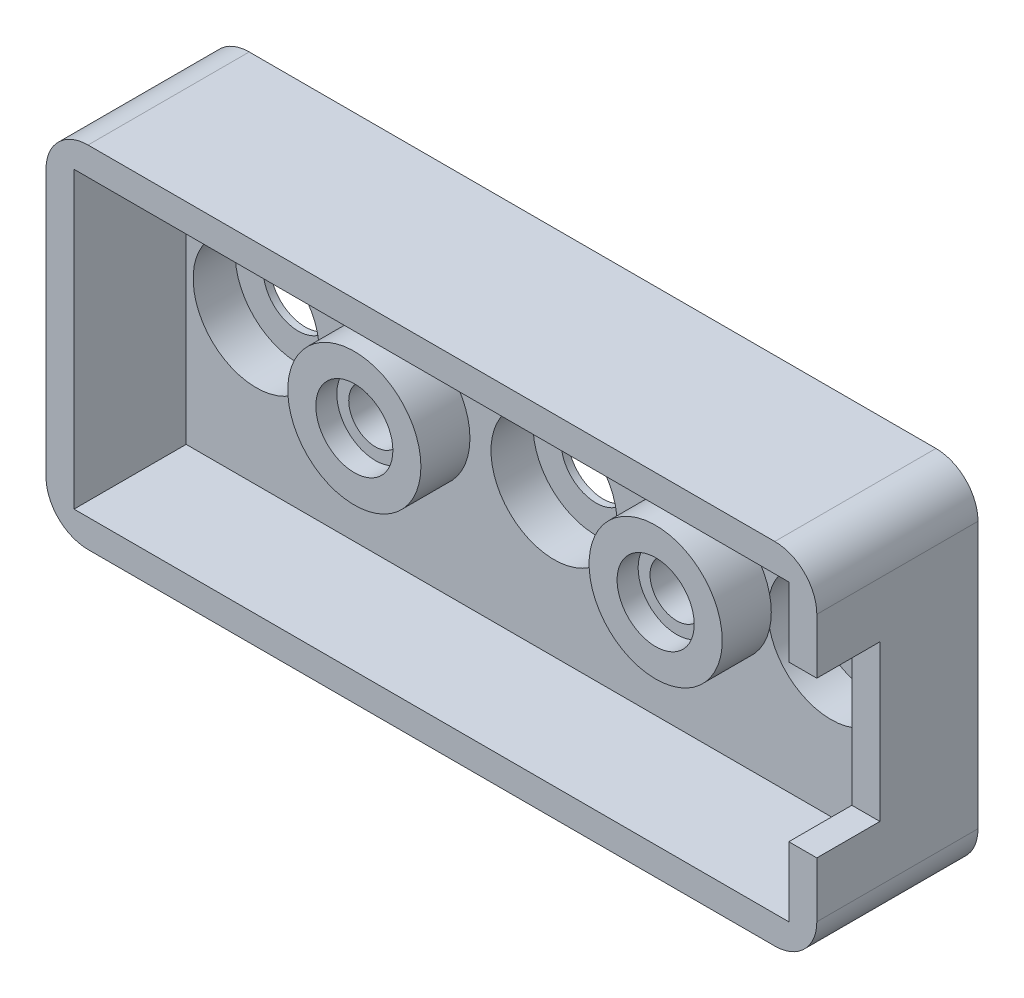
ISO-10303-21;
HEADER;
FILE_DESCRIPTION(('STEP AP214'),'2;1');
FILE_NAME('part.step','',(''),(''),'','','');
FILE_SCHEMA(('AUTOMOTIVE_DESIGN { 1 0 10303 214 1 1 1 1 }'));
ENDSEC;
DATA;
#1=APPLICATION_CONTEXT('core data for automotive mechanical design processes');
#2=APPLICATION_PROTOCOL_DEFINITION('international standard','automotive_design',2000,#1);
#3=PRODUCT_CONTEXT('',#1,'mechanical');
#4=PRODUCT('Part','Part','',(#3));
#5=PRODUCT_RELATED_PRODUCT_CATEGORY('part','',(#4));
#6=PRODUCT_DEFINITION_FORMATION('','',#4);
#7=PRODUCT_DEFINITION_CONTEXT('part definition',#1,'design');
#8=PRODUCT_DEFINITION('design','',#6,#7);
#9=PRODUCT_DEFINITION_SHAPE('','',#8);
#10=(LENGTH_UNIT() NAMED_UNIT(*) SI_UNIT(.MILLI.,.METRE.));
#11=(NAMED_UNIT(*) PLANE_ANGLE_UNIT() SI_UNIT($,.RADIAN.));
#12=(NAMED_UNIT(*) SI_UNIT($,.STERADIAN.) SOLID_ANGLE_UNIT());
#13=UNCERTAINTY_MEASURE_WITH_UNIT(LENGTH_MEASURE(1.E-05),#10,'distance_accuracy_value','');
#14=(GEOMETRIC_REPRESENTATION_CONTEXT(3) GLOBAL_UNCERTAINTY_ASSIGNED_CONTEXT((#13)) GLOBAL_UNIT_ASSIGNED_CONTEXT((#10,
#11,#12)) REPRESENTATION_CONTEXT('',''));
#15=CARTESIAN_POINT('',(0.,0.,0.));
#16=DIRECTION('',(0.,0.,1.));
#17=DIRECTION('',(1.,0.,0.));
#18=AXIS2_PLACEMENT_3D('',#15,#16,#17);
#19=CARTESIAN_POINT('',(-10.,0.,-1.5));
#20=DIRECTION('',(0.,0.,1.));
#21=DIRECTION('',(1.,0.,0.));
#22=AXIS2_PLACEMENT_3D('',#19,#20,#21);
#23=CYLINDRICAL_SURFACE('',#22,2.75);
#24=CARTESIAN_POINT('',(-10.,0.,5.5));
#25=DIRECTION('',(0.,0.,1.));
#26=DIRECTION('',(1.,0.,0.));
#27=AXIS2_PLACEMENT_3D('',#24,#25,#26);
#28=CIRCLE('',#27,2.75);
#29=CARTESIAN_POINT('',(-7.25000000000001,0.,5.5));
#30=VERTEX_POINT('',#29);
#31=EDGE_CURVE('E218',#30,#30,#28,.T.);
#32=ORIENTED_EDGE('',*,*,#31,.T.);
#33=EDGE_LOOP('',(#32));
#34=FACE_BOUND('',#33,.T.);
#35=CARTESIAN_POINT('',(-10.,0.,4.));
#36=DIRECTION('',(0.,0.,-1.));
#37=DIRECTION('',(-1.,0.,0.));
#38=AXIS2_PLACEMENT_3D('',#35,#36,#37);
#39=CIRCLE('',#38,2.75);
#40=CARTESIAN_POINT('',(-12.75,0.,4.));
#41=VERTEX_POINT('',#40);
#42=EDGE_CURVE('E12',#41,#41,#39,.F.);
#43=ORIENTED_EDGE('',*,*,#42,.F.);
#44=EDGE_LOOP('',(#43));
#45=FACE_BOUND('',#44,.T.);
#46=ADVANCED_FACE('F75',(#34,#45),#23,.F.);
#47=CARTESIAN_POINT('',(11.5,0.,-1.5));
#48=DIRECTION('',(0.,0.,1.));
#49=DIRECTION('',(1.,0.,0.));
#50=AXIS2_PLACEMENT_3D('',#47,#48,#49);
#51=CYLINDRICAL_SURFACE('',#50,2.75);
#52=CARTESIAN_POINT('',(11.5,0.,5.5));
#53=DIRECTION('',(0.,0.,1.));
#54=DIRECTION('',(1.,0.,0.));
#55=AXIS2_PLACEMENT_3D('',#52,#53,#54);
#56=CIRCLE('',#55,2.75);
#57=CARTESIAN_POINT('',(14.25,0.,5.5));
#58=VERTEX_POINT('',#57);
#59=EDGE_CURVE('E216',#58,#58,#56,.T.);
#60=ORIENTED_EDGE('',*,*,#59,.T.);
#61=EDGE_LOOP('',(#60));
#62=FACE_BOUND('',#61,.T.);
#63=CARTESIAN_POINT('',(11.5,0.,4.));
#64=DIRECTION('',(0.,0.,-1.));
#65=DIRECTION('',(-1.,0.,0.));
#66=AXIS2_PLACEMENT_3D('',#63,#64,#65);
#67=CIRCLE('',#66,2.75);
#68=CARTESIAN_POINT('',(8.74999999999999,0.,4.));
#69=VERTEX_POINT('',#68);
#70=EDGE_CURVE('E84',#69,#69,#67,.F.);
#71=ORIENTED_EDGE('',*,*,#70,.F.);
#72=EDGE_LOOP('',(#71));
#73=FACE_BOUND('',#72,.T.);
#74=ADVANCED_FACE('F435',(#62,#73),#51,.F.);
#75=CARTESIAN_POINT('',(0.,0.,2.));
#76=DIRECTION('',(0.,0.,1.));
#77=DIRECTION('',(1.,0.,0.));
#78=AXIS2_PLACEMENT_3D('',#75,#76,#77);
#79=PLANE('',#78);
#80=CARTESIAN_POINT('',(20.5018902687231,0.,2.));
#81=DIRECTION('',(0.,0.,1.));
#82=DIRECTION('',(1.,0.,0.));
#83=AXIS2_PLACEMENT_3D('',#80,#81,#82);
#84=CIRCLE('',#83,4.5);
#85=CARTESIAN_POINT('',(16.1293903792472,-1.06359988554604,2.));
#86=VERTEX_POINT('',#85);
#87=CARTESIAN_POINT('',(16.1293903792472,1.06359988554604,2.));
#88=VERTEX_POINT('',#87);
#89=EDGE_CURVE('E193',#86,#88,#84,.T.);
#90=ORIENTED_EDGE('',*,*,#89,.F.);
#91=CARTESIAN_POINT('',(11.5,0.,2.));
#92=DIRECTION('',(0.,0.,1.));
#93=DIRECTION('',(1.,0.,0.));
#94=AXIS2_PLACEMENT_3D('',#91,#92,#93);
#95=CIRCLE('',#94,4.75);
#96=EDGE_CURVE('E211',#88,#86,#95,.T.);
#97=ORIENTED_EDGE('',*,*,#96,.F.);
#98=EDGE_LOOP('',(#90,#97));
#99=FACE_BOUND('',#98,.T.);
#100=CARTESIAN_POINT('',(0.749999999999993,0.,2.));
#101=DIRECTION('',(0.,0.,1.));
#102=DIRECTION('',(1.,0.,0.));
#103=AXIS2_PLACEMENT_3D('',#100,#101,#102);
#104=CIRCLE('',#103,4.5);
#105=CARTESIAN_POINT('',(5.24999999999999,0.,2.));
#106=VERTEX_POINT('',#105);
#107=EDGE_CURVE('E312',#106,#106,#104,.T.);
#108=ORIENTED_EDGE('',*,*,#107,.F.);
#109=EDGE_LOOP('',(#108));
#110=FACE_BOUND('',#109,.T.);
#111=CARTESIAN_POINT('',(-20.5,0.,2.));
#112=DIRECTION('',(0.,0.,1.));
#113=DIRECTION('',(1.,0.,0.));
#114=AXIS2_PLACEMENT_3D('',#111,#112,#113);
#115=CIRCLE('',#114,4.5);
#116=CARTESIAN_POINT('',(-16.,0.,2.));
#117=VERTEX_POINT('',#116);
#118=EDGE_CURVE('E309',#117,#117,#115,.T.);
#119=ORIENTED_EDGE('',*,*,#118,.F.);
#120=EDGE_LOOP('',(#119));
#121=FACE_BOUND('',#120,.T.);
#122=DIRECTION('',(1.,0.,0.));
#123=VECTOR('',#122,1.);
#124=CARTESIAN_POINT('',(-25.5,-10.5,2.));
#125=LINE('',#124,#123);
#126=CARTESIAN_POINT('',(-25.5,-10.5,2.));
#127=VERTEX_POINT('',#126);
#128=CARTESIAN_POINT('',(25.5,-10.5,2.));
#129=VERTEX_POINT('',#128);
#130=EDGE_CURVE('E329',#127,#129,#125,.T.);
#131=ORIENTED_EDGE('',*,*,#130,.T.);
#132=DIRECTION('',(0.,-1.,0.));
#133=VECTOR('',#132,1.);
#134=CARTESIAN_POINT('',(25.5,10.5,2.));
#135=LINE('',#134,#133);
#136=CARTESIAN_POINT('',(25.5,10.5,2.));
#137=VERTEX_POINT('',#136);
#138=EDGE_CURVE('E350',#137,#129,#135,.T.);
#139=ORIENTED_EDGE('',*,*,#138,.F.);
#140=DIRECTION('',(1.,0.,0.));
#141=VECTOR('',#140,1.);
#142=CARTESIAN_POINT('',(-25.5,10.5,2.));
#143=LINE('',#142,#141);
#144=CARTESIAN_POINT('',(-25.5,10.5,2.));
#145=VERTEX_POINT('',#144);
#146=EDGE_CURVE('E353',#145,#137,#143,.T.);
#147=ORIENTED_EDGE('',*,*,#146,.F.);
#148=DIRECTION('',(0.,-1.,0.));
#149=VECTOR('',#148,1.);
#150=CARTESIAN_POINT('',(-25.5,10.5,2.));
#151=LINE('',#150,#149);
#152=EDGE_CURVE('E339',#145,#127,#151,.T.);
#153=ORIENTED_EDGE('',*,*,#152,.T.);
#154=EDGE_LOOP('',(#131,#139,#147,#153));
#155=FACE_BOUND('',#154,.T.);
#156=CARTESIAN_POINT('',(-10.,0.,2.));
#157=DIRECTION('',(0.,0.,1.));
#158=DIRECTION('',(1.,0.,0.));
#159=AXIS2_PLACEMENT_3D('',#156,#157,#158);
#160=CIRCLE('',#159,4.75);
#161=CARTESIAN_POINT('',(-5.25000000000001,0.,2.));
#162=VERTEX_POINT('',#161);
#163=EDGE_CURVE('E228',#162,#162,#160,.T.);
#164=ORIENTED_EDGE('',*,*,#163,.F.);
#165=EDGE_LOOP('',(#164));
#166=FACE_BOUND('',#165,.T.);
#167=ADVANCED_FACE('F214',(#99,#110,#121,#155,#166),#79,.T.);
#168=CARTESIAN_POINT('',(27.5,12.5,-1.5));
#169=DIRECTION('',(1.,0.,0.));
#170=DIRECTION('',(0.,0.,-1.));
#171=AXIS2_PLACEMENT_3D('',#168,#169,#170);
#172=PLANE('',#171);
#173=DIRECTION('',(0.,-1.,0.));
#174=VECTOR('',#173,1.);
#175=CARTESIAN_POINT('',(27.5,5.55104168263553,5.5));
#176=LINE('',#175,#174);
#177=CARTESIAN_POINT('',(27.5,5.55104168263553,5.5));
#178=VERTEX_POINT('',#177);
#179=CARTESIAN_POINT('',(27.5,-5.55104168263553,5.5));
#180=VERTEX_POINT('',#179);
#181=EDGE_CURVE('E502',#178,#180,#176,.T.);
#182=ORIENTED_EDGE('',*,*,#181,.T.);
#183=DIRECTION('',(0.,0.,1.));
#184=VECTOR('',#183,1.);
#185=CARTESIAN_POINT('',(27.5,-5.55104168263553,4.));
#186=LINE('',#185,#184);
#187=CARTESIAN_POINT('',(27.5,-5.55104168263553,10.));
#188=VERTEX_POINT('',#187);
#189=EDGE_CURVE('E97',#180,#188,#186,.T.);
#190=ORIENTED_EDGE('',*,*,#189,.T.);
#191=DIRECTION('',(0.,1.,0.));
#192=VECTOR('',#191,1.);
#193=CARTESIAN_POINT('',(27.5,-12.5,10.));
#194=LINE('',#193,#192);
#195=CARTESIAN_POINT('',(27.5,-9.5,10.));
#196=VERTEX_POINT('',#195);
#197=EDGE_CURVE('E372',#196,#188,#194,.T.);
#198=ORIENTED_EDGE('',*,*,#197,.F.);
#199=DIRECTION('',(0.,0.,1.));
#200=VECTOR('',#199,1.);
#201=CARTESIAN_POINT('',(27.5,-9.5,-1.5));
#202=LINE('',#201,#200);
#203=CARTESIAN_POINT('',(27.5,-9.5,-1.5));
#204=VERTEX_POINT('',#203);
#205=EDGE_CURVE('E272',#196,#204,#202,.F.);
#206=ORIENTED_EDGE('',*,*,#205,.T.);
#207=DIRECTION('',(0.,1.,0.));
#208=VECTOR('',#207,1.);
#209=CARTESIAN_POINT('',(27.5,12.5,-1.5));
#210=LINE('',#209,#208);
#211=CARTESIAN_POINT('',(27.5,9.5,-1.5));
#212=VERTEX_POINT('',#211);
#213=EDGE_CURVE('E232',#204,#212,#210,.T.);
#214=ORIENTED_EDGE('',*,*,#213,.T.);
#215=DIRECTION('',(0.,0.,1.));
#216=VECTOR('',#215,1.);
#217=CARTESIAN_POINT('',(27.5,9.5,-1.5));
#218=LINE('',#217,#216);
#219=CARTESIAN_POINT('',(27.5,9.49999999999999,10.));
#220=VERTEX_POINT('',#219);
#221=EDGE_CURVE('E274',#212,#220,#218,.T.);
#222=ORIENTED_EDGE('',*,*,#221,.T.);
#223=CARTESIAN_POINT('',(27.5,5.55104168263553,10.));
#224=VERTEX_POINT('',#223);
#225=EDGE_CURVE('E371',#224,#220,#194,.T.);
#226=ORIENTED_EDGE('',*,*,#225,.F.);
#227=DIRECTION('',(0.,0.,1.));
#228=VECTOR('',#227,1.);
#229=CARTESIAN_POINT('',(27.5,5.55104168263553,4.));
#230=LINE('',#229,#228);
#231=EDGE_CURVE('E327',#178,#224,#230,.T.);
#232=ORIENTED_EDGE('',*,*,#231,.F.);
#233=EDGE_LOOP('',(#182,#190,#198,#206,#214,#222,#226,#232));
#234=FACE_BOUND('',#233,.T.);
#235=ADVANCED_FACE('F405',(#234),#172,.T.);
#236=CARTESIAN_POINT('',(-27.5,-12.5,-1.5));
#237=DIRECTION('',(0.,-1.,0.));
#238=DIRECTION('',(0.,0.,-1.));
#239=AXIS2_PLACEMENT_3D('',#236,#237,#238);
#240=PLANE('',#239);
#241=DIRECTION('',(1.,0.,0.));
#242=VECTOR('',#241,1.);
#243=CARTESIAN_POINT('',(-27.5,-12.5,-1.5));
#244=LINE('',#243,#242);
#245=CARTESIAN_POINT('',(-24.5,-12.5,-1.5));
#246=VERTEX_POINT('',#245);
#247=CARTESIAN_POINT('',(24.5,-12.5,-1.5));
#248=VERTEX_POINT('',#247);
#249=EDGE_CURVE('E243',#246,#248,#244,.T.);
#250=ORIENTED_EDGE('',*,*,#249,.T.);
#251=DIRECTION('',(0.,0.,1.));
#252=VECTOR('',#251,1.);
#253=CARTESIAN_POINT('',(24.5,-12.5,-1.5));
#254=LINE('',#253,#252);
#255=CARTESIAN_POINT('',(24.5,-12.5,10.));
#256=VERTEX_POINT('',#255);
#257=EDGE_CURVE('E201',#248,#256,#254,.T.);
#258=ORIENTED_EDGE('',*,*,#257,.T.);
#259=DIRECTION('',(1.,0.,0.));
#260=VECTOR('',#259,1.);
#261=CARTESIAN_POINT('',(-27.5,-12.5,10.));
#262=LINE('',#261,#260);
#263=CARTESIAN_POINT('',(-24.5,-12.5,10.));
#264=VERTEX_POINT('',#263);
#265=EDGE_CURVE('E374',#264,#256,#262,.T.);
#266=ORIENTED_EDGE('',*,*,#265,.F.);
#267=DIRECTION('',(0.,0.,1.));
#268=VECTOR('',#267,1.);
#269=CARTESIAN_POINT('',(-24.5,-12.5,-1.5));
#270=LINE('',#269,#268);
#271=EDGE_CURVE('E277',#264,#246,#270,.F.);
#272=ORIENTED_EDGE('',*,*,#271,.T.);
#273=EDGE_LOOP('',(#250,#258,#266,#272));
#274=FACE_BOUND('',#273,.T.);
#275=ADVANCED_FACE('F415',(#274),#240,.T.);
#276=CARTESIAN_POINT('',(-27.5,12.5,-1.5));
#277=DIRECTION('',(-1.,0.,0.));
#278=DIRECTION('',(0.,-1.,0.));
#279=AXIS2_PLACEMENT_3D('',#276,#277,#278);
#280=PLANE('',#279);
#281=DIRECTION('',(0.,1.,0.));
#282=VECTOR('',#281,1.);
#283=CARTESIAN_POINT('',(-27.5,-12.5,10.));
#284=LINE('',#283,#282);
#285=CARTESIAN_POINT('',(-27.5,-9.5,10.));
#286=VERTEX_POINT('',#285);
#287=CARTESIAN_POINT('',(-27.5,9.49999999999999,10.));
#288=VERTEX_POINT('',#287);
#289=EDGE_CURVE('E222',#286,#288,#284,.T.);
#290=ORIENTED_EDGE('',*,*,#289,.T.);
#291=DIRECTION('',(0.,0.,1.));
#292=VECTOR('',#291,1.);
#293=CARTESIAN_POINT('',(-27.5,9.5,-1.5));
#294=LINE('',#293,#292);
#295=CARTESIAN_POINT('',(-27.5,9.5,-1.5));
#296=VERTEX_POINT('',#295);
#297=EDGE_CURVE('E262',#288,#296,#294,.F.);
#298=ORIENTED_EDGE('',*,*,#297,.T.);
#299=DIRECTION('',(0.,-1.,0.));
#300=VECTOR('',#299,1.);
#301=CARTESIAN_POINT('',(-27.5,12.5,-1.5));
#302=LINE('',#301,#300);
#303=CARTESIAN_POINT('',(-27.5,-9.5,-1.5));
#304=VERTEX_POINT('',#303);
#305=EDGE_CURVE('E240',#296,#304,#302,.T.);
#306=ORIENTED_EDGE('',*,*,#305,.T.);
#307=DIRECTION('',(0.,0.,1.));
#308=VECTOR('',#307,1.);
#309=CARTESIAN_POINT('',(-27.5,-9.5,-1.5));
#310=LINE('',#309,#308);
#311=EDGE_CURVE('E259',#304,#286,#310,.T.);
#312=ORIENTED_EDGE('',*,*,#311,.T.);
#313=EDGE_LOOP('',(#290,#298,#306,#312));
#314=FACE_BOUND('',#313,.T.);
#315=ADVANCED_FACE('F382',(#314),#280,.T.);
#316=CARTESIAN_POINT('',(-27.5,12.5,-1.5));
#317=DIRECTION('',(0.,1.,0.));
#318=DIRECTION('',(0.,0.,1.));
#319=AXIS2_PLACEMENT_3D('',#316,#317,#318);
#320=PLANE('',#319);
#321=DIRECTION('',(-1.,0.,0.));
#322=VECTOR('',#321,1.);
#323=CARTESIAN_POINT('',(-27.5,12.5,-1.5));
#324=LINE('',#323,#322);
#325=CARTESIAN_POINT('',(24.5,12.5,-1.5));
#326=VERTEX_POINT('',#325);
#327=CARTESIAN_POINT('',(-24.5,12.5,-1.5));
#328=VERTEX_POINT('',#327);
#329=EDGE_CURVE('E237',#326,#328,#324,.T.);
#330=ORIENTED_EDGE('',*,*,#329,.T.);
#331=DIRECTION('',(0.,0.,1.));
#332=VECTOR('',#331,1.);
#333=CARTESIAN_POINT('',(-24.5,12.5,-1.5));
#334=LINE('',#333,#332);
#335=CARTESIAN_POINT('',(-24.5,12.5,10.));
#336=VERTEX_POINT('',#335);
#337=EDGE_CURVE('E248',#328,#336,#334,.T.);
#338=ORIENTED_EDGE('',*,*,#337,.T.);
#339=DIRECTION('',(1.,0.,0.));
#340=VECTOR('',#339,1.);
#341=CARTESIAN_POINT('',(-27.5,12.5,10.));
#342=LINE('',#341,#340);
#343=CARTESIAN_POINT('',(24.5,12.5,10.));
#344=VERTEX_POINT('',#343);
#345=EDGE_CURVE('E368',#336,#344,#342,.T.);
#346=ORIENTED_EDGE('',*,*,#345,.T.);
#347=DIRECTION('',(0.,0.,1.));
#348=VECTOR('',#347,1.);
#349=CARTESIAN_POINT('',(24.5,12.5,-1.5));
#350=LINE('',#349,#348);
#351=EDGE_CURVE('E246',#344,#326,#350,.F.);
#352=ORIENTED_EDGE('',*,*,#351,.T.);
#353=EDGE_LOOP('',(#330,#338,#346,#352));
#354=FACE_BOUND('',#353,.T.);
#355=ADVANCED_FACE('F394',(#354),#320,.T.);
#356=CARTESIAN_POINT('',(0.,0.,-1.5));
#357=DIRECTION('',(0.,0.,1.));
#358=DIRECTION('',(1.,0.,0.));
#359=AXIS2_PLACEMENT_3D('',#356,#357,#358);
#360=PLANE('',#359);
#361=CARTESIAN_POINT('',(20.5018902687231,0.,-1.5));
#362=DIRECTION('',(0.,0.,1.));
#363=DIRECTION('',(1.,0.,0.));
#364=AXIS2_PLACEMENT_3D('',#361,#362,#363);
#365=CIRCLE('',#364,2.5);
#366=CARTESIAN_POINT('',(23.0018902687231,0.,-1.5));
#367=VERTEX_POINT('',#366);
#368=EDGE_CURVE('E293',#367,#367,#365,.T.);
#369=ORIENTED_EDGE('',*,*,#368,.T.);
#370=EDGE_LOOP('',(#369));
#371=FACE_BOUND('',#370,.T.);
#372=CARTESIAN_POINT('',(0.749999999999993,0.,-1.5));
#373=DIRECTION('',(0.,0.,1.));
#374=DIRECTION('',(1.,0.,0.));
#375=AXIS2_PLACEMENT_3D('',#372,#373,#374);
#376=CIRCLE('',#375,2.5);
#377=CARTESIAN_POINT('',(3.24999999999999,0.,-1.5));
#378=VERTEX_POINT('',#377);
#379=EDGE_CURVE('E511',#378,#378,#376,.T.);
#380=ORIENTED_EDGE('',*,*,#379,.T.);
#381=EDGE_LOOP('',(#380));
#382=FACE_BOUND('',#381,.T.);
#383=CARTESIAN_POINT('',(-20.5,0.,-1.5));
#384=DIRECTION('',(0.,0.,1.));
#385=DIRECTION('',(1.,0.,0.));
#386=AXIS2_PLACEMENT_3D('',#383,#384,#385);
#387=CIRCLE('',#386,2.5);
#388=CARTESIAN_POINT('',(-18.,0.,-1.5));
#389=VERTEX_POINT('',#388);
#390=EDGE_CURVE('E507',#389,#389,#387,.T.);
#391=ORIENTED_EDGE('',*,*,#390,.T.);
#392=EDGE_LOOP('',(#391));
#393=FACE_BOUND('',#392,.T.);
#394=CARTESIAN_POINT('',(-10.,0.,-1.5));
#395=DIRECTION('',(0.,0.,1.));
#396=DIRECTION('',(1.,0.,0.));
#397=AXIS2_PLACEMENT_3D('',#394,#395,#396);
#398=CIRCLE('',#397,1.9);
#399=CARTESIAN_POINT('',(-8.10000000000001,0.,-1.5));
#400=VERTEX_POINT('',#399);
#401=EDGE_CURVE('E287',#400,#400,#398,.T.);
#402=ORIENTED_EDGE('',*,*,#401,.T.);
#403=EDGE_LOOP('',(#402));
#404=FACE_BOUND('',#403,.T.);
#405=CARTESIAN_POINT('',(11.5,0.,-1.5));
#406=DIRECTION('',(0.,0.,1.));
#407=DIRECTION('',(1.,0.,0.));
#408=AXIS2_PLACEMENT_3D('',#405,#406,#407);
#409=CIRCLE('',#408,1.9);
#410=CARTESIAN_POINT('',(13.4,0.,-1.5));
#411=VERTEX_POINT('',#410);
#412=EDGE_CURVE('E298',#411,#411,#409,.T.);
#413=ORIENTED_EDGE('',*,*,#412,.T.);
#414=EDGE_LOOP('',(#413));
#415=FACE_BOUND('',#414,.T.);
#416=ORIENTED_EDGE('',*,*,#305,.F.);
#417=CARTESIAN_POINT('',(-24.5,9.5,-1.5));
#418=DIRECTION('',(0.,0.,1.));
#419=DIRECTION('',(1.,0.,0.));
#420=AXIS2_PLACEMENT_3D('',#417,#418,#419);
#421=CIRCLE('',#420,3.);
#422=EDGE_CURVE('E270',#296,#328,#421,.F.);
#423=ORIENTED_EDGE('',*,*,#422,.T.);
#424=ORIENTED_EDGE('',*,*,#329,.F.);
#425=CARTESIAN_POINT('',(24.5,9.5,-1.5));
#426=DIRECTION('',(0.,0.,1.));
#427=DIRECTION('',(1.,0.,0.));
#428=AXIS2_PLACEMENT_3D('',#425,#426,#427);
#429=CIRCLE('',#428,3.);
#430=EDGE_CURVE('E268',#326,#212,#429,.F.);
#431=ORIENTED_EDGE('',*,*,#430,.T.);
#432=ORIENTED_EDGE('',*,*,#213,.F.);
#433=CARTESIAN_POINT('',(24.5,-9.5,-1.5));
#434=DIRECTION('',(0.,0.,1.));
#435=DIRECTION('',(1.,0.,0.));
#436=AXIS2_PLACEMENT_3D('',#433,#434,#435);
#437=CIRCLE('',#436,3.);
#438=EDGE_CURVE('E266',#204,#248,#437,.F.);
#439=ORIENTED_EDGE('',*,*,#438,.T.);
#440=ORIENTED_EDGE('',*,*,#249,.F.);
#441=CARTESIAN_POINT('',(-24.5,-9.5,-1.5));
#442=DIRECTION('',(0.,0.,1.));
#443=DIRECTION('',(1.,0.,0.));
#444=AXIS2_PLACEMENT_3D('',#441,#442,#443);
#445=CIRCLE('',#444,3.);
#446=EDGE_CURVE('E264',#246,#304,#445,.F.);
#447=ORIENTED_EDGE('',*,*,#446,.T.);
#448=EDGE_LOOP('',(#416,#423,#424,#431,#432,#439,#440,#447));
#449=FACE_BOUND('',#448,.T.);
#450=ADVANCED_FACE('F391',(#371,#382,#393,#404,#415,#449),#360,.F.);
#451=CARTESIAN_POINT('',(-10.,0.,5.5));
#452=DIRECTION('',(0.,0.,1.));
#453=DIRECTION('',(1.,0.,0.));
#454=AXIS2_PLACEMENT_3D('',#451,#452,#453);
#455=PLANE('',#454);
#456=CARTESIAN_POINT('',(-10.,0.,5.5));
#457=DIRECTION('',(0.,0.,1.));
#458=DIRECTION('',(1.,0.,0.));
#459=AXIS2_PLACEMENT_3D('',#456,#457,#458);
#460=CIRCLE('',#459,4.75);
#461=CARTESIAN_POINT('',(-5.25000000000001,0.,5.5));
#462=VERTEX_POINT('',#461);
#463=EDGE_CURVE('E229',#462,#462,#460,.T.);
#464=ORIENTED_EDGE('',*,*,#463,.T.);
#465=EDGE_LOOP('',(#464));
#466=FACE_BOUND('',#465,.T.);
#467=ORIENTED_EDGE('',*,*,#31,.F.);
#468=EDGE_LOOP('',(#467));
#469=FACE_BOUND('',#468,.T.);
#470=ADVANCED_FACE('F448',(#466,#469),#455,.T.);
#471=CARTESIAN_POINT('',(-10.,0.,5.5));
#472=DIRECTION('',(0.,0.,-1.));
#473=DIRECTION('',(-1.,0.,0.));
#474=AXIS2_PLACEMENT_3D('',#471,#472,#473);
#475=CYLINDRICAL_SURFACE('',#474,4.75);
#476=ORIENTED_EDGE('',*,*,#463,.F.);
#477=EDGE_LOOP('',(#476));
#478=FACE_BOUND('',#477,.T.);
#479=ORIENTED_EDGE('',*,*,#163,.T.);
#480=EDGE_LOOP('',(#479));
#481=FACE_BOUND('',#480,.T.);
#482=ADVANCED_FACE('F581',(#478,#481),#475,.T.);
#483=CARTESIAN_POINT('',(11.5,0.,5.5));
#484=DIRECTION('',(0.,0.,1.));
#485=DIRECTION('',(1.,0.,0.));
#486=AXIS2_PLACEMENT_3D('',#483,#484,#485);
#487=PLANE('',#486);
#488=CARTESIAN_POINT('',(11.5,0.,5.5));
#489=DIRECTION('',(0.,0.,1.));
#490=DIRECTION('',(1.,0.,0.));
#491=AXIS2_PLACEMENT_3D('',#488,#489,#490);
#492=CIRCLE('',#491,4.75);
#493=CARTESIAN_POINT('',(16.25,0.,5.5));
#494=VERTEX_POINT('',#493);
#495=EDGE_CURVE('E212',#494,#494,#492,.T.);
#496=ORIENTED_EDGE('',*,*,#495,.T.);
#497=EDGE_LOOP('',(#496));
#498=FACE_BOUND('',#497,.T.);
#499=ORIENTED_EDGE('',*,*,#59,.F.);
#500=EDGE_LOOP('',(#499));
#501=FACE_BOUND('',#500,.T.);
#502=ADVANCED_FACE('F431',(#498,#501),#487,.T.);
#503=CARTESIAN_POINT('',(11.5,0.,5.5));
#504=DIRECTION('',(0.,0.,-1.));
#505=DIRECTION('',(-1.,0.,0.));
#506=AXIS2_PLACEMENT_3D('',#503,#504,#505);
#507=CYLINDRICAL_SURFACE('',#506,4.75);
#508=ORIENTED_EDGE('',*,*,#495,.F.);
#509=EDGE_LOOP('',(#508));
#510=FACE_BOUND('',#509,.T.);
#511=ORIENTED_EDGE('',*,*,#96,.T.);
#512=EDGE_CURVE('E206',#86,#88,#95,.T.);
#513=ORIENTED_EDGE('',*,*,#512,.T.);
#514=EDGE_LOOP('',(#511,#513));
#515=FACE_BOUND('',#514,.T.);
#516=ADVANCED_FACE('F210',(#510,#515),#507,.T.);
#517=CARTESIAN_POINT('',(0.,0.,10.));
#518=DIRECTION('',(0.,0.,1.));
#519=DIRECTION('',(1.,0.,0.));
#520=AXIS2_PLACEMENT_3D('',#517,#518,#519);
#521=PLANE('',#520);
#522=DIRECTION('',(1.,0.,0.));
#523=VECTOR('',#522,1.);
#524=CARTESIAN_POINT('',(25.5,-5.55104168263553,10.));
#525=LINE('',#524,#523);
#526=CARTESIAN_POINT('',(25.5,-5.55104168263553,10.));
#527=VERTEX_POINT('',#526);
#528=EDGE_CURVE('E325',#527,#188,#525,.T.);
#529=ORIENTED_EDGE('',*,*,#528,.F.);
#530=DIRECTION('',(0.,-1.,0.));
#531=VECTOR('',#530,1.);
#532=CARTESIAN_POINT('',(25.5,10.5,10.));
#533=LINE('',#532,#531);
#534=CARTESIAN_POINT('',(25.5,-10.5,10.));
#535=VERTEX_POINT('',#534);
#536=EDGE_CURVE('E338',#527,#535,#533,.T.);
#537=ORIENTED_EDGE('',*,*,#536,.T.);
#538=DIRECTION('',(1.,0.,0.));
#539=VECTOR('',#538,1.);
#540=CARTESIAN_POINT('',(-25.5,-10.5,10.));
#541=LINE('',#540,#539);
#542=CARTESIAN_POINT('',(-25.5,-10.5,10.));
#543=VERTEX_POINT('',#542);
#544=EDGE_CURVE('E335',#543,#535,#541,.T.);
#545=ORIENTED_EDGE('',*,*,#544,.F.);
#546=DIRECTION('',(0.,-1.,0.));
#547=VECTOR('',#546,1.);
#548=CARTESIAN_POINT('',(-25.5,10.5,10.));
#549=LINE('',#548,#547);
#550=CARTESIAN_POINT('',(-25.5,10.5,10.));
#551=VERTEX_POINT('',#550);
#552=EDGE_CURVE('E346',#551,#543,#549,.T.);
#553=ORIENTED_EDGE('',*,*,#552,.F.);
#554=DIRECTION('',(1.,0.,0.));
#555=VECTOR('',#554,1.);
#556=CARTESIAN_POINT('',(-25.5,10.5,10.));
#557=LINE('',#556,#555);
#558=CARTESIAN_POINT('',(25.5,10.5,10.));
#559=VERTEX_POINT('',#558);
#560=EDGE_CURVE('E343',#551,#559,#557,.T.);
#561=ORIENTED_EDGE('',*,*,#560,.T.);
#562=CARTESIAN_POINT('',(25.5,5.55104168263553,10.));
#563=VERTEX_POINT('',#562);
#564=EDGE_CURVE('E340',#559,#563,#533,.T.);
#565=ORIENTED_EDGE('',*,*,#564,.T.);
#566=DIRECTION('',(-1.,0.,0.));
#567=VECTOR('',#566,1.);
#568=CARTESIAN_POINT('',(25.5,5.55104168263553,10.));
#569=LINE('',#568,#567);
#570=EDGE_CURVE('E320',#224,#563,#569,.T.);
#571=ORIENTED_EDGE('',*,*,#570,.F.);
#572=ORIENTED_EDGE('',*,*,#225,.T.);
#573=CARTESIAN_POINT('',(24.5,9.5,10.));
#574=DIRECTION('',(0.,0.,1.));
#575=DIRECTION('',(1.,0.,0.));
#576=AXIS2_PLACEMENT_3D('',#573,#574,#575);
#577=CIRCLE('',#576,3.);
#578=EDGE_CURVE('E255',#220,#344,#577,.T.);
#579=ORIENTED_EDGE('',*,*,#578,.T.);
#580=ORIENTED_EDGE('',*,*,#345,.F.);
#581=CARTESIAN_POINT('',(-24.5,9.5,10.));
#582=DIRECTION('',(0.,0.,1.));
#583=DIRECTION('',(1.,0.,0.));
#584=AXIS2_PLACEMENT_3D('',#581,#582,#583);
#585=CIRCLE('',#584,3.);
#586=EDGE_CURVE('E257',#336,#288,#585,.T.);
#587=ORIENTED_EDGE('',*,*,#586,.T.);
#588=ORIENTED_EDGE('',*,*,#289,.F.);
#589=CARTESIAN_POINT('',(-24.5,-9.5,10.));
#590=DIRECTION('',(0.,0.,1.));
#591=DIRECTION('',(1.,0.,0.));
#592=AXIS2_PLACEMENT_3D('',#589,#590,#591);
#593=CIRCLE('',#592,3.);
#594=EDGE_CURVE('E251',#286,#264,#593,.T.);
#595=ORIENTED_EDGE('',*,*,#594,.T.);
#596=ORIENTED_EDGE('',*,*,#265,.T.);
#597=CARTESIAN_POINT('',(24.5,-9.5,10.));
#598=DIRECTION('',(0.,0.,1.));
#599=DIRECTION('',(1.,0.,0.));
#600=AXIS2_PLACEMENT_3D('',#597,#598,#599);
#601=CIRCLE('',#600,3.);
#602=EDGE_CURVE('E253',#256,#196,#601,.T.);
#603=ORIENTED_EDGE('',*,*,#602,.T.);
#604=ORIENTED_EDGE('',*,*,#197,.T.);
#605=EDGE_LOOP('',(#529,#537,#545,#553,#561,#565,#571,#572,#579,#580,#587,#588,#595,#596,#603,#604));
#606=FACE_BOUND('',#605,.T.);
#607=ADVANCED_FACE('F419',(#606),#521,.T.);
#608=CARTESIAN_POINT('',(-25.5,-10.5,10.));
#609=DIRECTION('',(0.,1.,0.));
#610=DIRECTION('',(0.,0.,1.));
#611=AXIS2_PLACEMENT_3D('',#608,#609,#610);
#612=PLANE('',#611);
#613=ORIENTED_EDGE('',*,*,#130,.F.);
#614=DIRECTION('',(0.,0.,-1.));
#615=VECTOR('',#614,1.);
#616=CARTESIAN_POINT('',(-25.5,-10.5,10.));
#617=LINE('',#616,#615);
#618=EDGE_CURVE('E348',#543,#127,#617,.T.);
#619=ORIENTED_EDGE('',*,*,#618,.F.);
#620=ORIENTED_EDGE('',*,*,#544,.T.);
#621=DIRECTION('',(0.,0.,-1.));
#622=VECTOR('',#621,1.);
#623=CARTESIAN_POINT('',(25.5,-10.5,10.));
#624=LINE('',#623,#622);
#625=EDGE_CURVE('E365',#535,#129,#624,.T.);
#626=ORIENTED_EDGE('',*,*,#625,.T.);
#627=EDGE_LOOP('',(#613,#619,#620,#626));
#628=FACE_BOUND('',#627,.T.);
#629=ADVANCED_FACE('F422',(#628),#612,.T.);
#630=CARTESIAN_POINT('',(25.5,10.5,10.));
#631=DIRECTION('',(1.,0.,0.));
#632=DIRECTION('',(0.,1.,0.));
#633=AXIS2_PLACEMENT_3D('',#630,#631,#632);
#634=PLANE('',#633);
#635=DIRECTION('',(0.,0.,1.));
#636=VECTOR('',#635,1.);
#637=CARTESIAN_POINT('',(25.5,-5.55104168263553,4.));
#638=LINE('',#637,#636);
#639=CARTESIAN_POINT('',(25.5,-5.55104168263553,5.5));
#640=VERTEX_POINT('',#639);
#641=EDGE_CURVE('E330',#640,#527,#638,.T.);
#642=ORIENTED_EDGE('',*,*,#641,.F.);
#643=DIRECTION('',(0.,-1.,0.));
#644=VECTOR('',#643,1.);
#645=CARTESIAN_POINT('',(25.5,5.55104168263553,5.5));
#646=LINE('',#645,#644);
#647=CARTESIAN_POINT('',(25.5,5.55104168263553,5.5));
#648=VERTEX_POINT('',#647);
#649=EDGE_CURVE('E495',#648,#640,#646,.T.);
#650=ORIENTED_EDGE('',*,*,#649,.F.);
#651=DIRECTION('',(0.,0.,1.));
#652=VECTOR('',#651,1.);
#653=CARTESIAN_POINT('',(25.5,5.55104168263553,4.));
#654=LINE('',#653,#652);
#655=EDGE_CURVE('E332',#648,#563,#654,.T.);
#656=ORIENTED_EDGE('',*,*,#655,.T.);
#657=ORIENTED_EDGE('',*,*,#564,.F.);
#658=DIRECTION('',(0.,0.,-1.));
#659=VECTOR('',#658,1.);
#660=CARTESIAN_POINT('',(25.5,10.5,10.));
#661=LINE('',#660,#659);
#662=EDGE_CURVE('E362',#559,#137,#661,.T.);
#663=ORIENTED_EDGE('',*,*,#662,.T.);
#664=ORIENTED_EDGE('',*,*,#138,.T.);
#665=ORIENTED_EDGE('',*,*,#625,.F.);
#666=ORIENTED_EDGE('',*,*,#536,.F.);
#667=EDGE_LOOP('',(#642,#650,#656,#657,#663,#664,#665,#666));
#668=FACE_BOUND('',#667,.T.);
#669=ADVANCED_FACE('F428',(#668),#634,.F.);
#670=CARTESIAN_POINT('',(-25.5,10.5,10.));
#671=DIRECTION('',(0.,1.,0.));
#672=DIRECTION('',(0.,0.,1.));
#673=AXIS2_PLACEMENT_3D('',#670,#671,#672);
#674=PLANE('',#673);
#675=ORIENTED_EDGE('',*,*,#146,.T.);
#676=ORIENTED_EDGE('',*,*,#662,.F.);
#677=ORIENTED_EDGE('',*,*,#560,.F.);
#678=DIRECTION('',(0.,0.,-1.));
#679=VECTOR('',#678,1.);
#680=CARTESIAN_POINT('',(-25.5,10.5,10.));
#681=LINE('',#680,#679);
#682=EDGE_CURVE('E359',#551,#145,#681,.T.);
#683=ORIENTED_EDGE('',*,*,#682,.T.);
#684=EDGE_LOOP('',(#675,#676,#677,#683));
#685=FACE_BOUND('',#684,.T.);
#686=ADVANCED_FACE('F484',(#685),#674,.F.);
#687=CARTESIAN_POINT('',(-25.5,10.5,10.));
#688=DIRECTION('',(1.,0.,0.));
#689=DIRECTION('',(0.,1.,0.));
#690=AXIS2_PLACEMENT_3D('',#687,#688,#689);
#691=PLANE('',#690);
#692=ORIENTED_EDGE('',*,*,#152,.F.);
#693=ORIENTED_EDGE('',*,*,#682,.F.);
#694=ORIENTED_EDGE('',*,*,#552,.T.);
#695=ORIENTED_EDGE('',*,*,#618,.T.);
#696=EDGE_LOOP('',(#692,#693,#694,#695));
#697=FACE_BOUND('',#696,.T.);
#698=ADVANCED_FACE('F460',(#697),#691,.T.);
#699=CARTESIAN_POINT('',(-24.5,9.5,-1.5));
#700=DIRECTION('',(0.,0.,1.));
#701=DIRECTION('',(1.,0.,0.));
#702=AXIS2_PLACEMENT_3D('',#699,#700,#701);
#703=CYLINDRICAL_SURFACE('',#702,3.);
#704=ORIENTED_EDGE('',*,*,#422,.F.);
#705=ORIENTED_EDGE('',*,*,#297,.F.);
#706=ORIENTED_EDGE('',*,*,#586,.F.);
#707=ORIENTED_EDGE('',*,*,#337,.F.);
#708=EDGE_LOOP('',(#704,#705,#706,#707));
#709=FACE_BOUND('',#708,.T.);
#710=ADVANCED_FACE('F387',(#709),#703,.T.);
#711=CARTESIAN_POINT('',(24.5,9.5,-1.5));
#712=DIRECTION('',(0.,0.,1.));
#713=DIRECTION('',(1.,0.,0.));
#714=AXIS2_PLACEMENT_3D('',#711,#712,#713);
#715=CYLINDRICAL_SURFACE('',#714,3.);
#716=ORIENTED_EDGE('',*,*,#430,.F.);
#717=ORIENTED_EDGE('',*,*,#351,.F.);
#718=ORIENTED_EDGE('',*,*,#578,.F.);
#719=ORIENTED_EDGE('',*,*,#221,.F.);
#720=EDGE_LOOP('',(#716,#717,#718,#719));
#721=FACE_BOUND('',#720,.T.);
#722=ADVANCED_FACE('F399',(#721),#715,.T.);
#723=CARTESIAN_POINT('',(24.5,-9.5,-1.5));
#724=DIRECTION('',(0.,0.,1.));
#725=DIRECTION('',(1.,0.,0.));
#726=AXIS2_PLACEMENT_3D('',#723,#724,#725);
#727=CYLINDRICAL_SURFACE('',#726,3.);
#728=ORIENTED_EDGE('',*,*,#438,.F.);
#729=ORIENTED_EDGE('',*,*,#205,.F.);
#730=ORIENTED_EDGE('',*,*,#602,.F.);
#731=ORIENTED_EDGE('',*,*,#257,.F.);
#732=EDGE_LOOP('',(#728,#729,#730,#731));
#733=FACE_BOUND('',#732,.T.);
#734=ADVANCED_FACE('F410',(#733),#727,.T.);
#735=CARTESIAN_POINT('',(-24.5,-9.5,-1.5));
#736=DIRECTION('',(0.,0.,1.));
#737=DIRECTION('',(1.,0.,0.));
#738=AXIS2_PLACEMENT_3D('',#735,#736,#737);
#739=CYLINDRICAL_SURFACE('',#738,3.);
#740=ORIENTED_EDGE('',*,*,#446,.F.);
#741=ORIENTED_EDGE('',*,*,#271,.F.);
#742=ORIENTED_EDGE('',*,*,#594,.F.);
#743=ORIENTED_EDGE('',*,*,#311,.F.);
#744=EDGE_LOOP('',(#740,#741,#742,#743));
#745=FACE_BOUND('',#744,.T.);
#746=ADVANCED_FACE('F77',(#745),#739,.T.);
#747=CARTESIAN_POINT('',(25.5,-5.55104168263553,4.));
#748=DIRECTION('',(0.,-1.,0.));
#749=DIRECTION('',(0.,0.,-1.));
#750=AXIS2_PLACEMENT_3D('',#747,#748,#749);
#751=PLANE('',#750);
#752=ORIENTED_EDGE('',*,*,#189,.F.);
#753=DIRECTION('',(1.,0.,0.));
#754=VECTOR('',#753,1.);
#755=CARTESIAN_POINT('',(25.5,-5.55104168263553,5.5));
#756=LINE('',#755,#754);
#757=EDGE_CURVE('E92',#640,#180,#756,.T.);
#758=ORIENTED_EDGE('',*,*,#757,.F.);
#759=ORIENTED_EDGE('',*,*,#641,.T.);
#760=ORIENTED_EDGE('',*,*,#528,.T.);
#761=EDGE_LOOP('',(#752,#758,#759,#760));
#762=FACE_BOUND('',#761,.T.);
#763=ADVANCED_FACE('F466',(#762),#751,.F.);
#764=CARTESIAN_POINT('',(25.5,5.55104168263553,4.));
#765=DIRECTION('',(0.,1.,0.));
#766=DIRECTION('',(0.,0.,1.));
#767=AXIS2_PLACEMENT_3D('',#764,#765,#766);
#768=PLANE('',#767);
#769=ORIENTED_EDGE('',*,*,#655,.F.);
#770=DIRECTION('',(1.,0.,0.));
#771=VECTOR('',#770,1.);
#772=CARTESIAN_POINT('',(25.5,5.55104168263553,5.5));
#773=LINE('',#772,#771);
#774=EDGE_CURVE('E501',#648,#178,#773,.T.);
#775=ORIENTED_EDGE('',*,*,#774,.T.);
#776=ORIENTED_EDGE('',*,*,#231,.T.);
#777=ORIENTED_EDGE('',*,*,#570,.T.);
#778=EDGE_LOOP('',(#769,#775,#776,#777));
#779=FACE_BOUND('',#778,.T.);
#780=ADVANCED_FACE('F470',(#779),#768,.F.);
#781=CARTESIAN_POINT('',(-20.5,0.,-1.));
#782=DIRECTION('',(0.,0.,1.));
#783=DIRECTION('',(1.,0.,0.));
#784=AXIS2_PLACEMENT_3D('',#781,#782,#783);
#785=CYLINDRICAL_SURFACE('',#784,4.5);
#786=CARTESIAN_POINT('',(-20.5,0.,-1.));
#787=DIRECTION('',(0.,0.,1.));
#788=DIRECTION('',(1.,0.,0.));
#789=AXIS2_PLACEMENT_3D('',#786,#787,#788);
#790=CIRCLE('',#789,4.5);
#791=CARTESIAN_POINT('',(-16.,0.,-1.));
#792=VERTEX_POINT('',#791);
#793=EDGE_CURVE('E207',#792,#792,#790,.T.);
#794=ORIENTED_EDGE('',*,*,#793,.F.);
#795=EDGE_LOOP('',(#794));
#796=FACE_BOUND('',#795,.T.);
#797=ORIENTED_EDGE('',*,*,#118,.T.);
#798=EDGE_LOOP('',(#797));
#799=FACE_BOUND('',#798,.T.);
#800=ADVANCED_FACE('F475',(#796,#799),#785,.F.);
#801=CARTESIAN_POINT('',(-20.5,0.,-1.));
#802=DIRECTION('',(0.,0.,1.));
#803=DIRECTION('',(1.,0.,0.));
#804=AXIS2_PLACEMENT_3D('',#801,#802,#803);
#805=PLANE('',#804);
#806=CARTESIAN_POINT('',(-20.5,0.,-1.));
#807=DIRECTION('',(0.,0.,1.));
#808=DIRECTION('',(1.,0.,0.));
#809=AXIS2_PLACEMENT_3D('',#806,#807,#808);
#810=CIRCLE('',#809,2.5);
#811=CARTESIAN_POINT('',(-18.,0.,-1.));
#812=VERTEX_POINT('',#811);
#813=EDGE_CURVE('E79',#812,#812,#810,.T.);
#814=ORIENTED_EDGE('',*,*,#813,.F.);
#815=EDGE_LOOP('',(#814));
#816=FACE_BOUND('',#815,.T.);
#817=ORIENTED_EDGE('',*,*,#793,.T.);
#818=EDGE_LOOP('',(#817));
#819=FACE_BOUND('',#818,.T.);
#820=ADVANCED_FACE('F550',(#816,#819),#805,.T.);
#821=CARTESIAN_POINT('',(0.749999999999993,0.,-1.));
#822=DIRECTION('',(0.,0.,1.));
#823=DIRECTION('',(1.,0.,0.));
#824=AXIS2_PLACEMENT_3D('',#821,#822,#823);
#825=CYLINDRICAL_SURFACE('',#824,4.5);
#826=CARTESIAN_POINT('',(0.749999999999993,0.,-1.));
#827=DIRECTION('',(0.,0.,1.));
#828=DIRECTION('',(1.,0.,0.));
#829=AXIS2_PLACEMENT_3D('',#826,#827,#828);
#830=CIRCLE('',#829,4.5);
#831=CARTESIAN_POINT('',(5.24999999999999,0.,-1.));
#832=VERTEX_POINT('',#831);
#833=EDGE_CURVE('E317',#832,#832,#830,.T.);
#834=ORIENTED_EDGE('',*,*,#833,.F.);
#835=EDGE_LOOP('',(#834));
#836=FACE_BOUND('',#835,.T.);
#837=ORIENTED_EDGE('',*,*,#107,.T.);
#838=EDGE_LOOP('',(#837));
#839=FACE_BOUND('',#838,.T.);
#840=ADVANCED_FACE('F479',(#836,#839),#825,.F.);
#841=CARTESIAN_POINT('',(0.749999999999993,0.,-1.));
#842=DIRECTION('',(0.,0.,1.));
#843=DIRECTION('',(1.,0.,0.));
#844=AXIS2_PLACEMENT_3D('',#841,#842,#843);
#845=PLANE('',#844);
#846=CARTESIAN_POINT('',(0.749999999999993,0.,-1.));
#847=DIRECTION('',(0.,0.,1.));
#848=DIRECTION('',(1.,0.,0.));
#849=AXIS2_PLACEMENT_3D('',#846,#847,#848);
#850=CIRCLE('',#849,2.5);
#851=CARTESIAN_POINT('',(3.24999999999999,0.,-1.));
#852=VERTEX_POINT('',#851);
#853=EDGE_CURVE('E292',#852,#852,#850,.T.);
#854=ORIENTED_EDGE('',*,*,#853,.F.);
#855=EDGE_LOOP('',(#854));
#856=FACE_BOUND('',#855,.T.);
#857=ORIENTED_EDGE('',*,*,#833,.T.);
#858=EDGE_LOOP('',(#857));
#859=FACE_BOUND('',#858,.T.);
#860=ADVANCED_FACE('F560',(#856,#859),#845,.T.);
#861=CARTESIAN_POINT('',(20.5018902687231,0.,2.));
#862=DIRECTION('',(0.,0.,1.));
#863=DIRECTION('',(1.,0.,0.));
#864=AXIS2_PLACEMENT_3D('',#861,#862,#863);
#865=PLANE('',#864);
#866=EDGE_CURVE('E196',#88,#86,#84,.T.);
#867=ORIENTED_EDGE('',*,*,#866,.F.);
#868=ORIENTED_EDGE('',*,*,#512,.F.);
#869=EDGE_LOOP('',(#867,#868));
#870=FACE_BOUND('',#869,.T.);
#871=ADVANCED_FACE('F205',(#870),#865,.F.);
#872=CARTESIAN_POINT('',(20.5018902687231,0.,-1.));
#873=DIRECTION('',(0.,0.,1.));
#874=DIRECTION('',(1.,0.,0.));
#875=AXIS2_PLACEMENT_3D('',#872,#873,#874);
#876=CYLINDRICAL_SURFACE('',#875,4.5);
#877=CARTESIAN_POINT('',(20.5018902687231,0.,-1.));
#878=DIRECTION('',(0.,0.,1.));
#879=DIRECTION('',(1.,0.,0.));
#880=AXIS2_PLACEMENT_3D('',#877,#878,#879);
#881=CIRCLE('',#880,4.5);
#882=CARTESIAN_POINT('',(25.0018902687231,0.,-1.));
#883=VERTEX_POINT('',#882);
#884=EDGE_CURVE('E208',#883,#883,#881,.T.);
#885=ORIENTED_EDGE('',*,*,#884,.F.);
#886=EDGE_LOOP('',(#885));
#887=FACE_BOUND('',#886,.T.);
#888=ORIENTED_EDGE('',*,*,#866,.T.);
#889=ORIENTED_EDGE('',*,*,#89,.T.);
#890=EDGE_LOOP('',(#888,#889));
#891=FACE_BOUND('',#890,.T.);
#892=ADVANCED_FACE('F195',(#887,#891),#876,.F.);
#893=CARTESIAN_POINT('',(20.5018902687231,0.,-1.));
#894=DIRECTION('',(0.,0.,1.));
#895=DIRECTION('',(1.,0.,0.));
#896=AXIS2_PLACEMENT_3D('',#893,#894,#895);
#897=PLANE('',#896);
#898=CARTESIAN_POINT('',(20.5018902687231,0.,-1.));
#899=DIRECTION('',(0.,0.,1.));
#900=DIRECTION('',(1.,0.,0.));
#901=AXIS2_PLACEMENT_3D('',#898,#899,#900);
#902=CIRCLE('',#901,2.5);
#903=CARTESIAN_POINT('',(23.0018902687231,0.,-1.));
#904=VERTEX_POINT('',#903);
#905=EDGE_CURVE('E290',#904,#904,#902,.T.);
#906=ORIENTED_EDGE('',*,*,#905,.F.);
#907=EDGE_LOOP('',(#906));
#908=FACE_BOUND('',#907,.T.);
#909=ORIENTED_EDGE('',*,*,#884,.T.);
#910=EDGE_LOOP('',(#909));
#911=FACE_BOUND('',#910,.T.);
#912=ADVANCED_FACE('F546',(#908,#911),#897,.T.);
#913=CARTESIAN_POINT('',(11.5,0.,4.));
#914=DIRECTION('',(0.,0.,-1.));
#915=DIRECTION('',(-1.,0.,0.));
#916=AXIS2_PLACEMENT_3D('',#913,#914,#915);
#917=PLANE('',#916);
#918=CARTESIAN_POINT('',(11.5,0.,4.));
#919=DIRECTION('',(0.,0.,-1.));
#920=DIRECTION('',(-1.,0.,0.));
#921=AXIS2_PLACEMENT_3D('',#918,#919,#920);
#922=CIRCLE('',#921,1.9);
#923=CARTESIAN_POINT('',(9.59999999999999,0.,4.));
#924=VERTEX_POINT('',#923);
#925=EDGE_CURVE('E286',#924,#924,#922,.T.);
#926=ORIENTED_EDGE('',*,*,#925,.T.);
#927=EDGE_LOOP('',(#926));
#928=FACE_BOUND('',#927,.T.);
#929=ORIENTED_EDGE('',*,*,#70,.T.);
#930=EDGE_LOOP('',(#929));
#931=FACE_BOUND('',#930,.T.);
#932=ADVANCED_FACE('F542',(#928,#931),#917,.F.);
#933=CARTESIAN_POINT('',(-10.,0.,4.));
#934=DIRECTION('',(0.,0.,-1.));
#935=DIRECTION('',(-1.,0.,0.));
#936=AXIS2_PLACEMENT_3D('',#933,#934,#935);
#937=PLANE('',#936);
#938=CARTESIAN_POINT('',(-10.,0.,4.));
#939=DIRECTION('',(0.,0.,-1.));
#940=DIRECTION('',(-1.,0.,0.));
#941=AXIS2_PLACEMENT_3D('',#938,#939,#940);
#942=CIRCLE('',#941,1.9);
#943=CARTESIAN_POINT('',(-11.9,0.,4.));
#944=VERTEX_POINT('',#943);
#945=EDGE_CURVE('E283',#944,#944,#942,.T.);
#946=ORIENTED_EDGE('',*,*,#945,.T.);
#947=EDGE_LOOP('',(#946));
#948=FACE_BOUND('',#947,.T.);
#949=ORIENTED_EDGE('',*,*,#42,.T.);
#950=EDGE_LOOP('',(#949));
#951=FACE_BOUND('',#950,.T.);
#952=ADVANCED_FACE('F535',(#948,#951),#937,.F.);
#953=CARTESIAN_POINT('',(-10.,0.,-1.5));
#954=DIRECTION('',(0.,0.,1.));
#955=DIRECTION('',(1.,0.,0.));
#956=AXIS2_PLACEMENT_3D('',#953,#954,#955);
#957=CYLINDRICAL_SURFACE('',#956,1.9);
#958=ORIENTED_EDGE('',*,*,#401,.F.);
#959=EDGE_LOOP('',(#958));
#960=FACE_BOUND('',#959,.T.);
#961=ORIENTED_EDGE('',*,*,#945,.F.);
#962=EDGE_LOOP('',(#961));
#963=FACE_BOUND('',#962,.T.);
#964=ADVANCED_FACE('F531',(#960,#963),#957,.F.);
#965=CARTESIAN_POINT('',(11.5,0.,-1.5));
#966=DIRECTION('',(0.,0.,1.));
#967=DIRECTION('',(1.,0.,0.));
#968=AXIS2_PLACEMENT_3D('',#965,#966,#967);
#969=CYLINDRICAL_SURFACE('',#968,1.9);
#970=ORIENTED_EDGE('',*,*,#412,.F.);
#971=EDGE_LOOP('',(#970));
#972=FACE_BOUND('',#971,.T.);
#973=ORIENTED_EDGE('',*,*,#925,.F.);
#974=EDGE_LOOP('',(#973));
#975=FACE_BOUND('',#974,.T.);
#976=ADVANCED_FACE('F534',(#972,#975),#969,.F.);
#977=CARTESIAN_POINT('',(20.5018902687231,0.,-1.5));
#978=DIRECTION('',(0.,0.,1.));
#979=DIRECTION('',(1.,0.,0.));
#980=AXIS2_PLACEMENT_3D('',#977,#978,#979);
#981=CYLINDRICAL_SURFACE('',#980,2.5);
#982=ORIENTED_EDGE('',*,*,#905,.T.);
#983=EDGE_LOOP('',(#982));
#984=FACE_BOUND('',#983,.T.);
#985=ORIENTED_EDGE('',*,*,#368,.F.);
#986=EDGE_LOOP('',(#985));
#987=FACE_BOUND('',#986,.T.);
#988=ADVANCED_FACE('F527',(#984,#987),#981,.F.);
#989=CARTESIAN_POINT('',(0.749999999999993,0.,-1.5));
#990=DIRECTION('',(0.,0.,1.));
#991=DIRECTION('',(1.,0.,0.));
#992=AXIS2_PLACEMENT_3D('',#989,#990,#991);
#993=CYLINDRICAL_SURFACE('',#992,2.5);
#994=ORIENTED_EDGE('',*,*,#853,.T.);
#995=EDGE_LOOP('',(#994));
#996=FACE_BOUND('',#995,.T.);
#997=ORIENTED_EDGE('',*,*,#379,.F.);
#998=EDGE_LOOP('',(#997));
#999=FACE_BOUND('',#998,.T.);
#1000=ADVANCED_FACE('F520',(#996,#999),#993,.F.);
#1001=CARTESIAN_POINT('',(-20.5,0.,-1.5));
#1002=DIRECTION('',(0.,0.,1.));
#1003=DIRECTION('',(1.,0.,0.));
#1004=AXIS2_PLACEMENT_3D('',#1001,#1002,#1003);
#1005=CYLINDRICAL_SURFACE('',#1004,2.5);
#1006=ORIENTED_EDGE('',*,*,#813,.T.);
#1007=EDGE_LOOP('',(#1006));
#1008=FACE_BOUND('',#1007,.T.);
#1009=ORIENTED_EDGE('',*,*,#390,.F.);
#1010=EDGE_LOOP('',(#1009));
#1011=FACE_BOUND('',#1010,.T.);
#1012=ADVANCED_FACE('F518',(#1008,#1011),#1005,.F.);
#1013=CARTESIAN_POINT('',(25.5,5.55104168263553,5.5));
#1014=DIRECTION('',(0.,0.,1.));
#1015=DIRECTION('',(0.,-1.,0.));
#1016=AXIS2_PLACEMENT_3D('',#1013,#1014,#1015);
#1017=PLANE('',#1016);
#1018=ORIENTED_EDGE('',*,*,#181,.F.);
#1019=ORIENTED_EDGE('',*,*,#774,.F.);
#1020=ORIENTED_EDGE('',*,*,#649,.T.);
#1021=ORIENTED_EDGE('',*,*,#757,.T.);
#1022=EDGE_LOOP('',(#1018,#1019,#1020,#1021));
#1023=FACE_BOUND('',#1022,.T.);
#1024=ADVANCED_FACE('F500',(#1023),#1017,.T.);
#1025=CLOSED_SHELL('',(#46,#74,#167,#235,#275,#315,#355,#450,#470,#482,#502,#516,#607,#629,#669,
#686,#698,#710,#722,#734,#746,#763,#780,#800,#820,#840,#860,#871,#892,#912,#932,#952,#964,#976,
#988,#1000,#1012,#1024));
#1026=MANIFOLD_SOLID_BREP('B2',#1025);
#1027=ADVANCED_BREP_SHAPE_REPRESENTATION('',(#18,#1026),#14);
#1028=SHAPE_DEFINITION_REPRESENTATION(#9,#1027);
ENDSEC;
END-ISO-10303-21;
